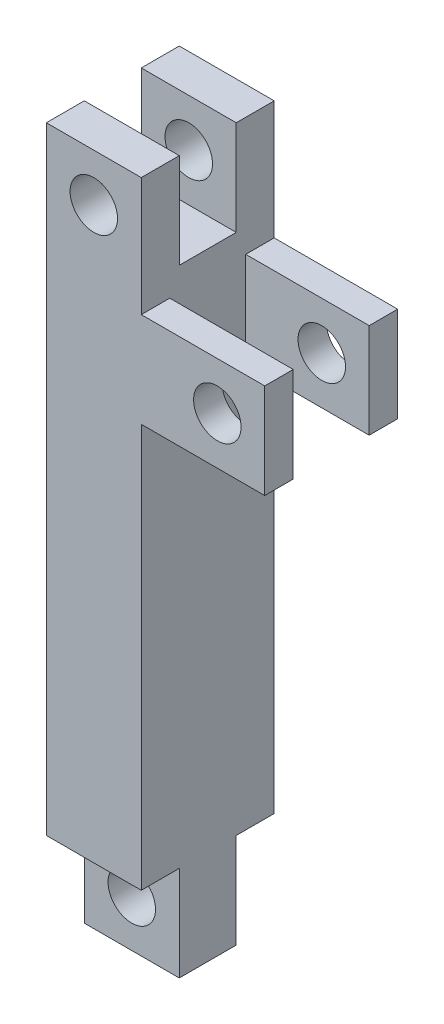
ISO-10303-21;
HEADER;
FILE_DESCRIPTION(('STEP AP214'),'2;1');
FILE_NAME('part.step','',(''),(''),'','','');
FILE_SCHEMA(('AUTOMOTIVE_DESIGN { 1 0 10303 214 1 1 1 1 }'));
ENDSEC;
DATA;
#1=APPLICATION_CONTEXT('core data for automotive mechanical design processes');
#2=APPLICATION_PROTOCOL_DEFINITION('international standard','automotive_design',2000,#1);
#3=PRODUCT_CONTEXT('',#1,'mechanical');
#4=PRODUCT('Part','Part','',(#3));
#5=PRODUCT_RELATED_PRODUCT_CATEGORY('part','',(#4));
#6=PRODUCT_DEFINITION_FORMATION('','',#4);
#7=PRODUCT_DEFINITION_CONTEXT('part definition',#1,'design');
#8=PRODUCT_DEFINITION('design','',#6,#7);
#9=PRODUCT_DEFINITION_SHAPE('','',#8);
#10=(LENGTH_UNIT() NAMED_UNIT(*) SI_UNIT(.MILLI.,.METRE.));
#11=(NAMED_UNIT(*) PLANE_ANGLE_UNIT() SI_UNIT($,.RADIAN.));
#12=(NAMED_UNIT(*) SI_UNIT($,.STERADIAN.) SOLID_ANGLE_UNIT());
#13=UNCERTAINTY_MEASURE_WITH_UNIT(LENGTH_MEASURE(1.E-05),#10,'distance_accuracy_value','');
#14=(GEOMETRIC_REPRESENTATION_CONTEXT(3) GLOBAL_UNCERTAINTY_ASSIGNED_CONTEXT((#13)) GLOBAL_UNIT_ASSIGNED_CONTEXT((#10,
#11,#12)) REPRESENTATION_CONTEXT('',''));
#15=CARTESIAN_POINT('',(0.,0.,0.));
#16=DIRECTION('',(0.,0.,1.));
#17=DIRECTION('',(1.,0.,0.));
#18=AXIS2_PLACEMENT_3D('',#15,#16,#17);
#19=CARTESIAN_POINT('',(0.,-32.5,0.));
#20=DIRECTION('',(0.,-1.,0.));
#21=DIRECTION('',(0.,0.,-1.));
#22=AXIS2_PLACEMENT_3D('',#19,#20,#21);
#23=PLANE('',#22);
#24=DIRECTION('',(0.,0.,-1.));
#25=VECTOR('',#24,1.);
#26=CARTESIAN_POINT('',(5.,-32.5,-7.));
#27=LINE('',#26,#25);
#28=CARTESIAN_POINT('',(5.,-32.5,-3.));
#29=VERTEX_POINT('',#28);
#30=CARTESIAN_POINT('',(5.,-32.5,-7.));
#31=VERTEX_POINT('',#30);
#32=EDGE_CURVE('E62',#29,#31,#27,.T.);
#33=ORIENTED_EDGE('',*,*,#32,.F.);
#34=DIRECTION('',(-1.,0.,0.));
#35=VECTOR('',#34,1.);
#36=CARTESIAN_POINT('',(5.,-32.5,-3.));
#37=LINE('',#36,#35);
#38=CARTESIAN_POINT('',(-5.,-32.5,-3.));
#39=VERTEX_POINT('',#38);
#40=EDGE_CURVE('E57',#29,#39,#37,.T.);
#41=ORIENTED_EDGE('',*,*,#40,.T.);
#42=DIRECTION('',(0.,0.,1.));
#43=VECTOR('',#42,1.);
#44=CARTESIAN_POINT('',(-5.,-32.5,-7.));
#45=LINE('',#44,#43);
#46=CARTESIAN_POINT('',(-5.,-32.5,-7.));
#47=VERTEX_POINT('',#46);
#48=EDGE_CURVE('E190',#47,#39,#45,.T.);
#49=ORIENTED_EDGE('',*,*,#48,.F.);
#50=DIRECTION('',(-1.,0.,0.));
#51=VECTOR('',#50,1.);
#52=CARTESIAN_POINT('',(5.,-32.5,-7.));
#53=LINE('',#52,#51);
#54=EDGE_CURVE('E191',#31,#47,#53,.T.);
#55=ORIENTED_EDGE('',*,*,#54,.F.);
#56=EDGE_LOOP('',(#33,#41,#49,#55));
#57=FACE_BOUND('',#56,.T.);
#58=ADVANCED_FACE('F39',(#57),#23,.T.);
#59=CARTESIAN_POINT('',(5.,32.5,-7.));
#60=DIRECTION('',(-1.,0.,0.));
#61=DIRECTION('',(0.,0.,1.));
#62=AXIS2_PLACEMENT_3D('',#59,#60,#61);
#63=PLANE('',#62);
#64=DIRECTION('',(0.,1.,0.));
#65=VECTOR('',#64,1.);
#66=CARTESIAN_POINT('',(5.,32.5,-3.));
#67=LINE('',#66,#65);
#68=CARTESIAN_POINT('',(5.,22.5,-3.));
#69=VERTEX_POINT('',#68);
#70=CARTESIAN_POINT('',(5.,32.5,-3.));
#71=VERTEX_POINT('',#70);
#72=EDGE_CURVE('E243',#69,#71,#67,.T.);
#73=ORIENTED_EDGE('',*,*,#72,.F.);
#74=DIRECTION('',(0.,0.,1.));
#75=VECTOR('',#74,1.);
#76=CARTESIAN_POINT('',(5.,22.5,-3.));
#77=LINE('',#76,#75);
#78=CARTESIAN_POINT('',(5.,22.5,3.));
#79=VERTEX_POINT('',#78);
#80=EDGE_CURVE('E264',#69,#79,#77,.T.);
#81=ORIENTED_EDGE('',*,*,#80,.T.);
#82=DIRECTION('',(0.,1.,0.));
#83=VECTOR('',#82,1.);
#84=CARTESIAN_POINT('',(5.,32.5,3.));
#85=LINE('',#84,#83);
#86=CARTESIAN_POINT('',(5.,32.5,3.));
#87=VERTEX_POINT('',#86);
#88=EDGE_CURVE('E257',#79,#87,#85,.T.);
#89=ORIENTED_EDGE('',*,*,#88,.T.);
#90=DIRECTION('',(0.,0.,-1.));
#91=VECTOR('',#90,1.);
#92=CARTESIAN_POINT('',(5.,32.5,-7.));
#93=LINE('',#92,#91);
#94=CARTESIAN_POINT('',(5.,32.5,7.));
#95=VERTEX_POINT('',#94);
#96=EDGE_CURVE('E353',#95,#87,#93,.T.);
#97=ORIENTED_EDGE('',*,*,#96,.F.);
#98=DIRECTION('',(0.,-1.,0.));
#99=VECTOR('',#98,1.);
#100=CARTESIAN_POINT('',(5.,32.5,7.));
#101=LINE('',#100,#99);
#102=CARTESIAN_POINT('',(5.,20.,7.));
#103=VERTEX_POINT('',#102);
#104=EDGE_CURVE('E378',#95,#103,#101,.T.);
#105=ORIENTED_EDGE('',*,*,#104,.T.);
#106=DIRECTION('',(0.,0.,-1.));
#107=VECTOR('',#106,1.);
#108=CARTESIAN_POINT('',(5.,20.,7.));
#109=LINE('',#108,#107);
#110=CARTESIAN_POINT('',(5.,20.,4.));
#111=VERTEX_POINT('',#110);
#112=EDGE_CURVE('E334',#103,#111,#109,.T.);
#113=ORIENTED_EDGE('',*,*,#112,.T.);
#114=DIRECTION('',(0.,-1.,0.));
#115=VECTOR('',#114,1.);
#116=CARTESIAN_POINT('',(5.,20.,4.));
#117=LINE('',#116,#115);
#118=CARTESIAN_POINT('',(5.,10.,4.));
#119=VERTEX_POINT('',#118);
#120=EDGE_CURVE('E283',#111,#119,#117,.T.);
#121=ORIENTED_EDGE('',*,*,#120,.T.);
#122=DIRECTION('',(0.,0.,-1.));
#123=VECTOR('',#122,1.);
#124=CARTESIAN_POINT('',(5.,10.,7.));
#125=LINE('',#124,#123);
#126=CARTESIAN_POINT('',(5.,10.,7.));
#127=VERTEX_POINT('',#126);
#128=EDGE_CURVE('E349',#127,#119,#125,.T.);
#129=ORIENTED_EDGE('',*,*,#128,.F.);
#130=CARTESIAN_POINT('',(5.,-32.5,7.));
#131=VERTEX_POINT('',#130);
#132=EDGE_CURVE('E369',#127,#131,#101,.T.);
#133=ORIENTED_EDGE('',*,*,#132,.T.);
#134=CARTESIAN_POINT('',(5.,-32.5,3.));
#135=VERTEX_POINT('',#134);
#136=EDGE_CURVE('E370',#131,#135,#27,.T.);
#137=ORIENTED_EDGE('',*,*,#136,.T.);
#138=DIRECTION('',(0.,1.,0.));
#139=VECTOR('',#138,1.);
#140=CARTESIAN_POINT('',(5.,-32.5,3.));
#141=LINE('',#140,#139);
#142=CARTESIAN_POINT('',(5.,-42.5,3.));
#143=VERTEX_POINT('',#142);
#144=EDGE_CURVE('E199',#143,#135,#141,.T.);
#145=ORIENTED_EDGE('',*,*,#144,.F.);
#146=DIRECTION('',(0.,0.,-1.));
#147=VECTOR('',#146,1.);
#148=CARTESIAN_POINT('',(5.,-42.5,3.));
#149=LINE('',#148,#147);
#150=CARTESIAN_POINT('',(5.,-42.5,-3.));
#151=VERTEX_POINT('',#150);
#152=EDGE_CURVE('E211',#143,#151,#149,.T.);
#153=ORIENTED_EDGE('',*,*,#152,.T.);
#154=DIRECTION('',(0.,1.,0.));
#155=VECTOR('',#154,1.);
#156=CARTESIAN_POINT('',(5.,-32.5,-3.));
#157=LINE('',#156,#155);
#158=EDGE_CURVE('E215',#151,#29,#157,.T.);
#159=ORIENTED_EDGE('',*,*,#158,.T.);
#160=ORIENTED_EDGE('',*,*,#32,.T.);
#161=DIRECTION('',(0.,-1.,0.));
#162=VECTOR('',#161,1.);
#163=CARTESIAN_POINT('',(5.,32.5,-7.));
#164=LINE('',#163,#162);
#165=CARTESIAN_POINT('',(5.,10.,-7.));
#166=VERTEX_POINT('',#165);
#167=EDGE_CURVE('E49',#166,#31,#164,.T.);
#168=ORIENTED_EDGE('',*,*,#167,.F.);
#169=CARTESIAN_POINT('',(5.,10.,-4.));
#170=VERTEX_POINT('',#169);
#171=EDGE_CURVE('E348',#170,#166,#125,.T.);
#172=ORIENTED_EDGE('',*,*,#171,.F.);
#173=DIRECTION('',(0.,-1.,0.));
#174=VECTOR('',#173,1.);
#175=CARTESIAN_POINT('',(5.,20.,-4.));
#176=LINE('',#175,#174);
#177=CARTESIAN_POINT('',(5.,20.,-4.));
#178=VERTEX_POINT('',#177);
#179=EDGE_CURVE('E284',#178,#170,#176,.T.);
#180=ORIENTED_EDGE('',*,*,#179,.F.);
#181=CARTESIAN_POINT('',(5.,20.,-7.));
#182=VERTEX_POINT('',#181);
#183=EDGE_CURVE('E323',#178,#182,#109,.T.);
#184=ORIENTED_EDGE('',*,*,#183,.T.);
#185=CARTESIAN_POINT('',(5.,32.5,-7.));
#186=VERTEX_POINT('',#185);
#187=EDGE_CURVE('E11',#186,#182,#164,.T.);
#188=ORIENTED_EDGE('',*,*,#187,.F.);
#189=EDGE_CURVE('E358',#71,#186,#93,.T.);
#190=ORIENTED_EDGE('',*,*,#189,.F.);
#191=EDGE_LOOP('',(#73,#81,#89,#97,#105,#113,#121,#129,#133,#137,#145,#153,#159,#160,#168,#172,
#180,#184,#188,#190));
#192=FACE_BOUND('',#191,.T.);
#193=ADVANCED_FACE('F41',(#192),#63,.F.);
#194=CARTESIAN_POINT('',(-5.,32.5,-7.));
#195=DIRECTION('',(1.,0.,0.));
#196=DIRECTION('',(0.,0.,-1.));
#197=AXIS2_PLACEMENT_3D('',#194,#195,#196);
#198=PLANE('',#197);
#199=DIRECTION('',(0.,-1.,0.));
#200=VECTOR('',#199,1.);
#201=CARTESIAN_POINT('',(-5.,32.5,-3.));
#202=LINE('',#201,#200);
#203=CARTESIAN_POINT('',(-5.,32.5,-3.));
#204=VERTEX_POINT('',#203);
#205=CARTESIAN_POINT('',(-5.,22.5,-3.));
#206=VERTEX_POINT('',#205);
#207=EDGE_CURVE('E234',#204,#206,#202,.T.);
#208=ORIENTED_EDGE('',*,*,#207,.F.);
#209=DIRECTION('',(0.,0.,1.));
#210=VECTOR('',#209,1.);
#211=CARTESIAN_POINT('',(-5.,32.5,-7.));
#212=LINE('',#211,#210);
#213=CARTESIAN_POINT('',(-5.,32.5,-7.));
#214=VERTEX_POINT('',#213);
#215=EDGE_CURVE('E362',#214,#204,#212,.T.);
#216=ORIENTED_EDGE('',*,*,#215,.F.);
#217=DIRECTION('',(0.,-1.,0.));
#218=VECTOR('',#217,1.);
#219=CARTESIAN_POINT('',(-5.,32.5,-7.));
#220=LINE('',#219,#218);
#221=EDGE_CURVE('E385',#214,#47,#220,.T.);
#222=ORIENTED_EDGE('',*,*,#221,.T.);
#223=ORIENTED_EDGE('',*,*,#48,.T.);
#224=DIRECTION('',(0.,-1.,0.));
#225=VECTOR('',#224,1.);
#226=CARTESIAN_POINT('',(-5.,-32.5,-3.));
#227=LINE('',#226,#225);
#228=CARTESIAN_POINT('',(-5.,-42.5,-3.));
#229=VERTEX_POINT('',#228);
#230=EDGE_CURVE('E222',#39,#229,#227,.T.);
#231=ORIENTED_EDGE('',*,*,#230,.T.);
#232=DIRECTION('',(0.,0.,-1.));
#233=VECTOR('',#232,1.);
#234=CARTESIAN_POINT('',(-5.,-42.5,3.));
#235=LINE('',#234,#233);
#236=CARTESIAN_POINT('',(-5.,-42.5,3.));
#237=VERTEX_POINT('',#236);
#238=EDGE_CURVE('E205',#237,#229,#235,.T.);
#239=ORIENTED_EDGE('',*,*,#238,.F.);
#240=DIRECTION('',(0.,-1.,0.));
#241=VECTOR('',#240,1.);
#242=CARTESIAN_POINT('',(-5.,-32.5,3.));
#243=LINE('',#242,#241);
#244=CARTESIAN_POINT('',(-5.,-32.5,3.));
#245=VERTEX_POINT('',#244);
#246=EDGE_CURVE('E196',#245,#237,#243,.T.);
#247=ORIENTED_EDGE('',*,*,#246,.F.);
#248=CARTESIAN_POINT('',(-5.,-32.5,7.));
#249=VERTEX_POINT('',#248);
#250=EDGE_CURVE('E177',#245,#249,#45,.T.);
#251=ORIENTED_EDGE('',*,*,#250,.T.);
#252=DIRECTION('',(0.,-1.,0.));
#253=VECTOR('',#252,1.);
#254=CARTESIAN_POINT('',(-5.,32.5,7.));
#255=LINE('',#254,#253);
#256=CARTESIAN_POINT('',(-5.,32.5,7.));
#257=VERTEX_POINT('',#256);
#258=EDGE_CURVE('E382',#257,#249,#255,.T.);
#259=ORIENTED_EDGE('',*,*,#258,.F.);
#260=CARTESIAN_POINT('',(-5.,32.5,3.));
#261=VERTEX_POINT('',#260);
#262=EDGE_CURVE('E361',#261,#257,#212,.T.);
#263=ORIENTED_EDGE('',*,*,#262,.F.);
#264=DIRECTION('',(0.,-1.,0.));
#265=VECTOR('',#264,1.);
#266=CARTESIAN_POINT('',(-5.,32.5,3.));
#267=LINE('',#266,#265);
#268=CARTESIAN_POINT('',(-5.,22.5,3.));
#269=VERTEX_POINT('',#268);
#270=EDGE_CURVE('E233',#261,#269,#267,.T.);
#271=ORIENTED_EDGE('',*,*,#270,.T.);
#272=DIRECTION('',(0.,0.,1.));
#273=VECTOR('',#272,1.);
#274=CARTESIAN_POINT('',(-5.,22.5,-3.));
#275=LINE('',#274,#273);
#276=EDGE_CURVE('E249',#206,#269,#275,.T.);
#277=ORIENTED_EDGE('',*,*,#276,.F.);
#278=EDGE_LOOP('',(#208,#216,#222,#223,#231,#239,#247,#251,#259,#263,#271,#277));
#279=FACE_BOUND('',#278,.T.);
#280=ADVANCED_FACE('F203',(#279),#198,.F.);
#281=CARTESIAN_POINT('',(0.,32.5,0.));
#282=DIRECTION('',(0.,-1.,0.));
#283=DIRECTION('',(0.,0.,-1.));
#284=AXIS2_PLACEMENT_3D('',#281,#282,#283);
#285=PLANE('',#284);
#286=DIRECTION('',(-1.,0.,0.));
#287=VECTOR('',#286,1.);
#288=CARTESIAN_POINT('',(-5.,32.5,-3.));
#289=LINE('',#288,#287);
#290=EDGE_CURVE('E246',#71,#204,#289,.T.);
#291=ORIENTED_EDGE('',*,*,#290,.F.);
#292=ORIENTED_EDGE('',*,*,#189,.T.);
#293=DIRECTION('',(-1.,0.,0.));
#294=VECTOR('',#293,1.);
#295=CARTESIAN_POINT('',(5.,32.5,-7.));
#296=LINE('',#295,#294);
#297=EDGE_CURVE('E357',#186,#214,#296,.T.);
#298=ORIENTED_EDGE('',*,*,#297,.T.);
#299=ORIENTED_EDGE('',*,*,#215,.T.);
#300=EDGE_LOOP('',(#291,#292,#298,#299));
#301=FACE_BOUND('',#300,.T.);
#302=ADVANCED_FACE('F469',(#301),#285,.F.);
#303=CARTESIAN_POINT('',(5.,10.,7.));
#304=DIRECTION('',(0.,1.,0.));
#305=DIRECTION('',(0.,0.,1.));
#306=AXIS2_PLACEMENT_3D('',#303,#304,#305);
#307=PLANE('',#306);
#308=DIRECTION('',(1.,0.,0.));
#309=VECTOR('',#308,1.);
#310=CARTESIAN_POINT('',(5.,10.,-4.));
#311=LINE('',#310,#309);
#312=CARTESIAN_POINT('',(18.,10.,-4.));
#313=VERTEX_POINT('',#312);
#314=EDGE_CURVE('E287',#170,#313,#311,.T.);
#315=ORIENTED_EDGE('',*,*,#314,.F.);
#316=ORIENTED_EDGE('',*,*,#171,.T.);
#317=DIRECTION('',(1.,0.,0.));
#318=VECTOR('',#317,1.);
#319=CARTESIAN_POINT('',(5.,10.,-7.));
#320=LINE('',#319,#318);
#321=CARTESIAN_POINT('',(18.,10.,-7.));
#322=VERTEX_POINT('',#321);
#323=EDGE_CURVE('E298',#166,#322,#320,.T.);
#324=ORIENTED_EDGE('',*,*,#323,.T.);
#325=DIRECTION('',(0.,0.,-1.));
#326=VECTOR('',#325,1.);
#327=CARTESIAN_POINT('',(18.,10.,7.));
#328=LINE('',#327,#326);
#329=EDGE_CURVE('E343',#313,#322,#328,.T.);
#330=ORIENTED_EDGE('',*,*,#329,.F.);
#331=EDGE_LOOP('',(#315,#316,#324,#330));
#332=FACE_BOUND('',#331,.T.);
#333=ADVANCED_FACE('F466',(#332),#307,.F.);
#334=CARTESIAN_POINT('',(18.,10.,7.));
#335=DIRECTION('',(-1.,0.,0.));
#336=DIRECTION('',(0.,0.,1.));
#337=AXIS2_PLACEMENT_3D('',#334,#335,#336);
#338=PLANE('',#337);
#339=DIRECTION('',(0.,1.,0.));
#340=VECTOR('',#339,1.);
#341=CARTESIAN_POINT('',(18.,20.,-4.));
#342=LINE('',#341,#340);
#343=CARTESIAN_POINT('',(18.,20.,-4.));
#344=VERTEX_POINT('',#343);
#345=EDGE_CURVE('E291',#313,#344,#342,.T.);
#346=ORIENTED_EDGE('',*,*,#345,.F.);
#347=ORIENTED_EDGE('',*,*,#329,.T.);
#348=DIRECTION('',(0.,1.,0.));
#349=VECTOR('',#348,1.);
#350=CARTESIAN_POINT('',(18.,10.,-7.));
#351=LINE('',#350,#349);
#352=CARTESIAN_POINT('',(18.,20.,-7.));
#353=VERTEX_POINT('',#352);
#354=EDGE_CURVE('E327',#322,#353,#351,.T.);
#355=ORIENTED_EDGE('',*,*,#354,.T.);
#356=DIRECTION('',(0.,0.,-1.));
#357=VECTOR('',#356,1.);
#358=CARTESIAN_POINT('',(18.,20.,7.));
#359=LINE('',#358,#357);
#360=EDGE_CURVE('E338',#344,#353,#359,.T.);
#361=ORIENTED_EDGE('',*,*,#360,.F.);
#362=EDGE_LOOP('',(#346,#347,#355,#361));
#363=FACE_BOUND('',#362,.T.);
#364=ADVANCED_FACE('F481',(#363),#338,.F.);
#365=CARTESIAN_POINT('',(5.,20.,7.));
#366=DIRECTION('',(0.,-1.,0.));
#367=DIRECTION('',(0.,0.,-1.));
#368=AXIS2_PLACEMENT_3D('',#365,#366,#367);
#369=PLANE('',#368);
#370=DIRECTION('',(-1.,0.,0.));
#371=VECTOR('',#370,1.);
#372=CARTESIAN_POINT('',(5.,20.,-4.));
#373=LINE('',#372,#371);
#374=EDGE_CURVE('E294',#344,#178,#373,.T.);
#375=ORIENTED_EDGE('',*,*,#374,.F.);
#376=ORIENTED_EDGE('',*,*,#360,.T.);
#377=DIRECTION('',(-1.,0.,0.));
#378=VECTOR('',#377,1.);
#379=CARTESIAN_POINT('',(5.,20.,-7.));
#380=LINE('',#379,#378);
#381=EDGE_CURVE('E317',#353,#182,#380,.T.);
#382=ORIENTED_EDGE('',*,*,#381,.T.);
#383=ORIENTED_EDGE('',*,*,#183,.F.);
#384=EDGE_LOOP('',(#375,#376,#382,#383));
#385=FACE_BOUND('',#384,.T.);
#386=ADVANCED_FACE('F501',(#385),#369,.F.);
#387=CARTESIAN_POINT('',(5.,32.5,-7.));
#388=DIRECTION('',(0.,0.,1.));
#389=DIRECTION('',(1.,0.,0.));
#390=AXIS2_PLACEMENT_3D('',#387,#388,#389);
#391=PLANE('',#390);
#392=CARTESIAN_POINT('',(0.,27.5,-7.));
#393=DIRECTION('',(0.,0.,1.));
#394=DIRECTION('',(1.,0.,0.));
#395=AXIS2_PLACEMENT_3D('',#392,#393,#394);
#396=CIRCLE('',#395,2.5);
#397=CARTESIAN_POINT('',(2.5,27.5,-7.));
#398=VERTEX_POINT('',#397);
#399=EDGE_CURVE('E394',#398,#398,#396,.T.);
#400=ORIENTED_EDGE('',*,*,#399,.T.);
#401=EDGE_LOOP('',(#400));
#402=FACE_BOUND('',#401,.T.);
#403=CARTESIAN_POINT('',(13.0055352682505,15.,-7.));
#404=DIRECTION('',(0.,0.,1.));
#405=DIRECTION('',(1.,0.,0.));
#406=AXIS2_PLACEMENT_3D('',#403,#404,#405);
#407=CIRCLE('',#406,2.5);
#408=CARTESIAN_POINT('',(15.5055352682505,15.,-7.));
#409=VERTEX_POINT('',#408);
#410=EDGE_CURVE('E274',#409,#409,#407,.T.);
#411=ORIENTED_EDGE('',*,*,#410,.T.);
#412=EDGE_LOOP('',(#411));
#413=FACE_BOUND('',#412,.T.);
#414=ORIENTED_EDGE('',*,*,#54,.T.);
#415=ORIENTED_EDGE('',*,*,#221,.F.);
#416=ORIENTED_EDGE('',*,*,#297,.F.);
#417=ORIENTED_EDGE('',*,*,#187,.T.);
#418=ORIENTED_EDGE('',*,*,#381,.F.);
#419=ORIENTED_EDGE('',*,*,#354,.F.);
#420=ORIENTED_EDGE('',*,*,#323,.F.);
#421=ORIENTED_EDGE('',*,*,#167,.T.);
#422=EDGE_LOOP('',(#414,#415,#416,#417,#418,#419,#420,#421));
#423=FACE_BOUND('',#422,.T.);
#424=ADVANCED_FACE('F473',(#402,#413,#423),#391,.F.);
#425=CARTESIAN_POINT('',(5.,32.5,7.));
#426=DIRECTION('',(0.,0.,-1.));
#427=DIRECTION('',(-1.,0.,0.));
#428=AXIS2_PLACEMENT_3D('',#425,#426,#427);
#429=PLANE('',#428);
#430=CARTESIAN_POINT('',(0.,27.5,7.));
#431=DIRECTION('',(0.,0.,1.));
#432=DIRECTION('',(1.,0.,0.));
#433=AXIS2_PLACEMENT_3D('',#430,#431,#432);
#434=CIRCLE('',#433,2.5);
#435=CARTESIAN_POINT('',(2.5,27.5,7.));
#436=VERTEX_POINT('',#435);
#437=EDGE_CURVE('E402',#436,#436,#434,.T.);
#438=ORIENTED_EDGE('',*,*,#437,.F.);
#439=EDGE_LOOP('',(#438));
#440=FACE_BOUND('',#439,.T.);
#441=CARTESIAN_POINT('',(13.0055352682505,15.,7.));
#442=DIRECTION('',(0.,0.,1.));
#443=DIRECTION('',(1.,0.,0.));
#444=AXIS2_PLACEMENT_3D('',#441,#442,#443);
#445=CIRCLE('',#444,2.5);
#446=CARTESIAN_POINT('',(15.5055352682505,15.,7.));
#447=VERTEX_POINT('',#446);
#448=EDGE_CURVE('E268',#447,#447,#445,.T.);
#449=ORIENTED_EDGE('',*,*,#448,.F.);
#450=EDGE_LOOP('',(#449));
#451=FACE_BOUND('',#450,.T.);
#452=DIRECTION('',(1.,0.,0.));
#453=VECTOR('',#452,1.);
#454=CARTESIAN_POINT('',(5.,-32.5,7.));
#455=LINE('',#454,#453);
#456=EDGE_CURVE('E184',#249,#131,#455,.T.);
#457=ORIENTED_EDGE('',*,*,#456,.T.);
#458=ORIENTED_EDGE('',*,*,#132,.F.);
#459=DIRECTION('',(1.,0.,0.));
#460=VECTOR('',#459,1.);
#461=CARTESIAN_POINT('',(5.,10.,7.));
#462=LINE('',#461,#460);
#463=CARTESIAN_POINT('',(18.,10.,7.));
#464=VERTEX_POINT('',#463);
#465=EDGE_CURVE('E313',#127,#464,#462,.T.);
#466=ORIENTED_EDGE('',*,*,#465,.T.);
#467=DIRECTION('',(0.,1.,0.));
#468=VECTOR('',#467,1.);
#469=CARTESIAN_POINT('',(18.,10.,7.));
#470=LINE('',#469,#468);
#471=CARTESIAN_POINT('',(18.,20.,7.));
#472=VERTEX_POINT('',#471);
#473=EDGE_CURVE('E316',#464,#472,#470,.T.);
#474=ORIENTED_EDGE('',*,*,#473,.T.);
#475=DIRECTION('',(-1.,0.,0.));
#476=VECTOR('',#475,1.);
#477=CARTESIAN_POINT('',(5.,20.,7.));
#478=LINE('',#477,#476);
#479=EDGE_CURVE('E320',#472,#103,#478,.T.);
#480=ORIENTED_EDGE('',*,*,#479,.T.);
#481=ORIENTED_EDGE('',*,*,#104,.F.);
#482=DIRECTION('',(1.,0.,0.));
#483=VECTOR('',#482,1.);
#484=CARTESIAN_POINT('',(5.,32.5,7.));
#485=LINE('',#484,#483);
#486=EDGE_CURVE('E366',#257,#95,#485,.T.);
#487=ORIENTED_EDGE('',*,*,#486,.F.);
#488=ORIENTED_EDGE('',*,*,#258,.T.);
#489=EDGE_LOOP('',(#457,#458,#466,#474,#480,#481,#487,#488));
#490=FACE_BOUND('',#489,.T.);
#491=ADVANCED_FACE('F467',(#440,#451,#490),#429,.F.);
#492=ORIENTED_EDGE('',*,*,#96,.T.);
#493=DIRECTION('',(-1.,0.,0.));
#494=VECTOR('',#493,1.);
#495=CARTESIAN_POINT('',(-5.,32.5,3.));
#496=LINE('',#495,#494);
#497=EDGE_CURVE('E239',#87,#261,#496,.T.);
#498=ORIENTED_EDGE('',*,*,#497,.T.);
#499=ORIENTED_EDGE('',*,*,#262,.T.);
#500=ORIENTED_EDGE('',*,*,#486,.T.);
#501=EDGE_LOOP('',(#492,#498,#499,#500));
#502=FACE_BOUND('',#501,.T.);
#503=ADVANCED_FACE('F458',(#502),#285,.F.);
#504=DIRECTION('',(-1.,0.,0.));
#505=VECTOR('',#504,1.);
#506=CARTESIAN_POINT('',(5.,-32.5,3.));
#507=LINE('',#506,#505);
#508=EDGE_CURVE('E181',#135,#245,#507,.T.);
#509=ORIENTED_EDGE('',*,*,#508,.F.);
#510=ORIENTED_EDGE('',*,*,#136,.F.);
#511=ORIENTED_EDGE('',*,*,#456,.F.);
#512=ORIENTED_EDGE('',*,*,#250,.F.);
#513=EDGE_LOOP('',(#509,#510,#511,#512));
#514=FACE_BOUND('',#513,.T.);
#515=ADVANCED_FACE('F179',(#514),#23,.T.);
#516=ORIENTED_EDGE('',*,*,#128,.T.);
#517=DIRECTION('',(1.,0.,0.));
#518=VECTOR('',#517,1.);
#519=CARTESIAN_POINT('',(5.,10.,4.));
#520=LINE('',#519,#518);
#521=CARTESIAN_POINT('',(18.,10.,4.));
#522=VERTEX_POINT('',#521);
#523=EDGE_CURVE('E302',#119,#522,#520,.T.);
#524=ORIENTED_EDGE('',*,*,#523,.T.);
#525=EDGE_CURVE('E344',#464,#522,#328,.T.);
#526=ORIENTED_EDGE('',*,*,#525,.F.);
#527=ORIENTED_EDGE('',*,*,#465,.F.);
#528=EDGE_LOOP('',(#516,#524,#526,#527));
#529=FACE_BOUND('',#528,.T.);
#530=ADVANCED_FACE('F457',(#529),#307,.F.);
#531=ORIENTED_EDGE('',*,*,#525,.T.);
#532=DIRECTION('',(0.,1.,0.));
#533=VECTOR('',#532,1.);
#534=CARTESIAN_POINT('',(18.,20.,4.));
#535=LINE('',#534,#533);
#536=CARTESIAN_POINT('',(18.,20.,4.));
#537=VERTEX_POINT('',#536);
#538=EDGE_CURVE('E306',#522,#537,#535,.T.);
#539=ORIENTED_EDGE('',*,*,#538,.T.);
#540=EDGE_CURVE('E339',#472,#537,#359,.T.);
#541=ORIENTED_EDGE('',*,*,#540,.F.);
#542=ORIENTED_EDGE('',*,*,#473,.F.);
#543=EDGE_LOOP('',(#531,#539,#541,#542));
#544=FACE_BOUND('',#543,.T.);
#545=ADVANCED_FACE('F463',(#544),#338,.F.);
#546=ORIENTED_EDGE('',*,*,#540,.T.);
#547=DIRECTION('',(-1.,0.,0.));
#548=VECTOR('',#547,1.);
#549=CARTESIAN_POINT('',(5.,20.,4.));
#550=LINE('',#549,#548);
#551=EDGE_CURVE('E288',#537,#111,#550,.T.);
#552=ORIENTED_EDGE('',*,*,#551,.T.);
#553=ORIENTED_EDGE('',*,*,#112,.F.);
#554=ORIENTED_EDGE('',*,*,#479,.F.);
#555=EDGE_LOOP('',(#546,#552,#553,#554));
#556=FACE_BOUND('',#555,.T.);
#557=ADVANCED_FACE('F520',(#556),#369,.F.);
#558=CARTESIAN_POINT('',(0.,0.,-4.));
#559=DIRECTION('',(0.,0.,1.));
#560=DIRECTION('',(1.,0.,0.));
#561=AXIS2_PLACEMENT_3D('',#558,#559,#560);
#562=PLANE('',#561);
#563=CARTESIAN_POINT('',(13.0055352682505,15.,-4.));
#564=DIRECTION('',(0.,0.,1.));
#565=DIRECTION('',(1.,0.,0.));
#566=AXIS2_PLACEMENT_3D('',#563,#564,#565);
#567=CIRCLE('',#566,2.5);
#568=CARTESIAN_POINT('',(15.5055352682505,15.,-4.));
#569=VERTEX_POINT('',#568);
#570=EDGE_CURVE('E279',#569,#569,#567,.T.);
#571=ORIENTED_EDGE('',*,*,#570,.F.);
#572=EDGE_LOOP('',(#571));
#573=FACE_BOUND('',#572,.T.);
#574=ORIENTED_EDGE('',*,*,#179,.T.);
#575=ORIENTED_EDGE('',*,*,#314,.T.);
#576=ORIENTED_EDGE('',*,*,#345,.T.);
#577=ORIENTED_EDGE('',*,*,#374,.T.);
#578=EDGE_LOOP('',(#574,#575,#576,#577));
#579=FACE_BOUND('',#578,.T.);
#580=ADVANCED_FACE('F536',(#573,#579),#562,.T.);
#581=CARTESIAN_POINT('',(0.,0.,4.));
#582=DIRECTION('',(0.,0.,1.));
#583=DIRECTION('',(1.,0.,0.));
#584=AXIS2_PLACEMENT_3D('',#581,#582,#583);
#585=PLANE('',#584);
#586=CARTESIAN_POINT('',(13.0055352682505,15.,4.));
#587=DIRECTION('',(0.,0.,1.));
#588=DIRECTION('',(1.,0.,0.));
#589=AXIS2_PLACEMENT_3D('',#586,#587,#588);
#590=CIRCLE('',#589,2.5);
#591=CARTESIAN_POINT('',(15.5055352682505,15.,4.));
#592=VERTEX_POINT('',#591);
#593=EDGE_CURVE('E278',#592,#592,#590,.T.);
#594=ORIENTED_EDGE('',*,*,#593,.T.);
#595=EDGE_LOOP('',(#594));
#596=FACE_BOUND('',#595,.T.);
#597=ORIENTED_EDGE('',*,*,#120,.F.);
#598=ORIENTED_EDGE('',*,*,#551,.F.);
#599=ORIENTED_EDGE('',*,*,#538,.F.);
#600=ORIENTED_EDGE('',*,*,#523,.F.);
#601=EDGE_LOOP('',(#597,#598,#599,#600));
#602=FACE_BOUND('',#601,.T.);
#603=ADVANCED_FACE('F523',(#596,#602),#585,.F.);
#604=CARTESIAN_POINT('',(13.0055352682505,15.,-7.));
#605=DIRECTION('',(0.,0.,1.));
#606=DIRECTION('',(1.,0.,0.));
#607=AXIS2_PLACEMENT_3D('',#604,#605,#606);
#608=CYLINDRICAL_SURFACE('',#607,2.5);
#609=ORIENTED_EDGE('',*,*,#448,.T.);
#610=EDGE_LOOP('',(#609));
#611=FACE_BOUND('',#610,.T.);
#612=ORIENTED_EDGE('',*,*,#593,.F.);
#613=EDGE_LOOP('',(#612));
#614=FACE_BOUND('',#613,.T.);
#615=ADVANCED_FACE('F555',(#611,#614),#608,.F.);
#616=ORIENTED_EDGE('',*,*,#570,.T.);
#617=EDGE_LOOP('',(#616));
#618=FACE_BOUND('',#617,.T.);
#619=ORIENTED_EDGE('',*,*,#410,.F.);
#620=EDGE_LOOP('',(#619));
#621=FACE_BOUND('',#620,.T.);
#622=ADVANCED_FACE('F558',(#618,#621),#608,.F.);
#623=CARTESIAN_POINT('',(-5.,22.5,-3.));
#624=DIRECTION('',(0.,-1.,0.));
#625=DIRECTION('',(0.,0.,-1.));
#626=AXIS2_PLACEMENT_3D('',#623,#624,#625);
#627=PLANE('',#626);
#628=DIRECTION('',(1.,0.,0.));
#629=VECTOR('',#628,1.);
#630=CARTESIAN_POINT('',(-5.,22.5,3.));
#631=LINE('',#630,#629);
#632=EDGE_CURVE('E253',#269,#79,#631,.T.);
#633=ORIENTED_EDGE('',*,*,#632,.T.);
#634=ORIENTED_EDGE('',*,*,#80,.F.);
#635=DIRECTION('',(1.,0.,0.));
#636=VECTOR('',#635,1.);
#637=CARTESIAN_POINT('',(-5.,22.5,-3.));
#638=LINE('',#637,#636);
#639=EDGE_CURVE('E238',#206,#69,#638,.T.);
#640=ORIENTED_EDGE('',*,*,#639,.F.);
#641=ORIENTED_EDGE('',*,*,#276,.T.);
#642=EDGE_LOOP('',(#633,#634,#640,#641));
#643=FACE_BOUND('',#642,.T.);
#644=ADVANCED_FACE('F508',(#643),#627,.F.);
#645=CARTESIAN_POINT('',(0.,0.,-3.));
#646=DIRECTION('',(0.,0.,1.));
#647=DIRECTION('',(1.,0.,0.));
#648=AXIS2_PLACEMENT_3D('',#645,#646,#647);
#649=PLANE('',#648);
#650=CARTESIAN_POINT('',(0.,27.5,-3.));
#651=DIRECTION('',(0.,0.,1.));
#652=DIRECTION('',(1.,0.,0.));
#653=AXIS2_PLACEMENT_3D('',#650,#651,#652);
#654=CIRCLE('',#653,2.5);
#655=CARTESIAN_POINT('',(2.5,27.5,-3.));
#656=VERTEX_POINT('',#655);
#657=EDGE_CURVE('E219',#656,#656,#654,.T.);
#658=ORIENTED_EDGE('',*,*,#657,.F.);
#659=EDGE_LOOP('',(#658));
#660=FACE_BOUND('',#659,.T.);
#661=ORIENTED_EDGE('',*,*,#207,.T.);
#662=ORIENTED_EDGE('',*,*,#639,.T.);
#663=ORIENTED_EDGE('',*,*,#72,.T.);
#664=ORIENTED_EDGE('',*,*,#290,.T.);
#665=EDGE_LOOP('',(#661,#662,#663,#664));
#666=FACE_BOUND('',#665,.T.);
#667=ADVANCED_FACE('F446',(#660,#666),#649,.T.);
#668=CARTESIAN_POINT('',(0.,0.,3.));
#669=DIRECTION('',(0.,0.,1.));
#670=DIRECTION('',(1.,0.,0.));
#671=AXIS2_PLACEMENT_3D('',#668,#669,#670);
#672=PLANE('',#671);
#673=CARTESIAN_POINT('',(0.,27.5,3.));
#674=DIRECTION('',(0.,0.,1.));
#675=DIRECTION('',(1.,0.,0.));
#676=AXIS2_PLACEMENT_3D('',#673,#674,#675);
#677=CIRCLE('',#676,2.5);
#678=CARTESIAN_POINT('',(2.5,27.5,3.));
#679=VERTEX_POINT('',#678);
#680=EDGE_CURVE('E391',#679,#679,#677,.T.);
#681=ORIENTED_EDGE('',*,*,#680,.T.);
#682=EDGE_LOOP('',(#681));
#683=FACE_BOUND('',#682,.T.);
#684=ORIENTED_EDGE('',*,*,#270,.F.);
#685=ORIENTED_EDGE('',*,*,#497,.F.);
#686=ORIENTED_EDGE('',*,*,#88,.F.);
#687=ORIENTED_EDGE('',*,*,#632,.F.);
#688=EDGE_LOOP('',(#684,#685,#686,#687));
#689=FACE_BOUND('',#688,.T.);
#690=ADVANCED_FACE('F439',(#683,#689),#672,.F.);
#691=CARTESIAN_POINT('',(5.,-42.5,3.));
#692=DIRECTION('',(0.,1.,0.));
#693=DIRECTION('',(0.,0.,1.));
#694=AXIS2_PLACEMENT_3D('',#691,#692,#693);
#695=PLANE('',#694);
#696=DIRECTION('',(1.,0.,0.));
#697=VECTOR('',#696,1.);
#698=CARTESIAN_POINT('',(5.,-42.5,-3.));
#699=LINE('',#698,#697);
#700=EDGE_CURVE('E225',#229,#151,#699,.T.);
#701=ORIENTED_EDGE('',*,*,#700,.T.);
#702=ORIENTED_EDGE('',*,*,#152,.F.);
#703=DIRECTION('',(1.,0.,0.));
#704=VECTOR('',#703,1.);
#705=CARTESIAN_POINT('',(5.,-42.5,3.));
#706=LINE('',#705,#704);
#707=EDGE_CURVE('E208',#237,#143,#706,.T.);
#708=ORIENTED_EDGE('',*,*,#707,.F.);
#709=ORIENTED_EDGE('',*,*,#238,.T.);
#710=EDGE_LOOP('',(#701,#702,#708,#709));
#711=FACE_BOUND('',#710,.T.);
#712=ADVANCED_FACE('F437',(#711),#695,.F.);
#713=CARTESIAN_POINT('',(0.,0.,3.));
#714=DIRECTION('',(0.,0.,-1.));
#715=DIRECTION('',(-1.,0.,0.));
#716=AXIS2_PLACEMENT_3D('',#713,#714,#715);
#717=PLANE('',#716);
#718=CARTESIAN_POINT('',(0.,-37.5,3.));
#719=DIRECTION('',(0.,0.,-1.));
#720=DIRECTION('',(-1.,0.,0.));
#721=AXIS2_PLACEMENT_3D('',#718,#719,#720);
#722=CIRCLE('',#721,2.5);
#723=CARTESIAN_POINT('',(-2.5,-37.5,3.));
#724=VERTEX_POINT('',#723);
#725=EDGE_CURVE('E408',#724,#724,#722,.T.);
#726=ORIENTED_EDGE('',*,*,#725,.T.);
#727=EDGE_LOOP('',(#726));
#728=FACE_BOUND('',#727,.T.);
#729=ORIENTED_EDGE('',*,*,#144,.T.);
#730=ORIENTED_EDGE('',*,*,#508,.T.);
#731=ORIENTED_EDGE('',*,*,#246,.T.);
#732=ORIENTED_EDGE('',*,*,#707,.T.);
#733=EDGE_LOOP('',(#729,#730,#731,#732));
#734=FACE_BOUND('',#733,.T.);
#735=ADVANCED_FACE('F195',(#728,#734),#717,.F.);
#736=CARTESIAN_POINT('',(0.,0.,-3.));
#737=DIRECTION('',(0.,0.,-1.));
#738=DIRECTION('',(-1.,0.,0.));
#739=AXIS2_PLACEMENT_3D('',#736,#737,#738);
#740=PLANE('',#739);
#741=CARTESIAN_POINT('',(0.,-37.5,-3.));
#742=DIRECTION('',(0.,0.,-1.));
#743=DIRECTION('',(-1.,0.,0.));
#744=AXIS2_PLACEMENT_3D('',#741,#742,#743);
#745=CIRCLE('',#744,2.5);
#746=CARTESIAN_POINT('',(-2.5,-37.5,-3.));
#747=VERTEX_POINT('',#746);
#748=EDGE_CURVE('E43',#747,#747,#745,.T.);
#749=ORIENTED_EDGE('',*,*,#748,.F.);
#750=EDGE_LOOP('',(#749));
#751=FACE_BOUND('',#750,.T.);
#752=ORIENTED_EDGE('',*,*,#158,.F.);
#753=ORIENTED_EDGE('',*,*,#700,.F.);
#754=ORIENTED_EDGE('',*,*,#230,.F.);
#755=ORIENTED_EDGE('',*,*,#40,.F.);
#756=EDGE_LOOP('',(#752,#753,#754,#755));
#757=FACE_BOUND('',#756,.T.);
#758=ADVANCED_FACE('F423',(#751,#757),#740,.T.);
#759=CARTESIAN_POINT('',(0.,27.5,-7.));
#760=DIRECTION('',(0.,0.,1.));
#761=DIRECTION('',(1.,0.,0.));
#762=AXIS2_PLACEMENT_3D('',#759,#760,#761);
#763=CYLINDRICAL_SURFACE('',#762,2.5);
#764=ORIENTED_EDGE('',*,*,#437,.T.);
#765=EDGE_LOOP('',(#764));
#766=FACE_BOUND('',#765,.T.);
#767=ORIENTED_EDGE('',*,*,#680,.F.);
#768=EDGE_LOOP('',(#767));
#769=FACE_BOUND('',#768,.T.);
#770=ADVANCED_FACE('F426',(#766,#769),#763,.F.);
#771=ORIENTED_EDGE('',*,*,#657,.T.);
#772=EDGE_LOOP('',(#771));
#773=FACE_BOUND('',#772,.T.);
#774=ORIENTED_EDGE('',*,*,#399,.F.);
#775=EDGE_LOOP('',(#774));
#776=FACE_BOUND('',#775,.T.);
#777=ADVANCED_FACE('F569',(#773,#776),#763,.F.);
#778=CARTESIAN_POINT('',(0.,-37.5,-7.));
#779=DIRECTION('',(0.,0.,1.));
#780=DIRECTION('',(1.,0.,0.));
#781=AXIS2_PLACEMENT_3D('',#778,#779,#780);
#782=CYLINDRICAL_SURFACE('',#781,2.5);
#783=ORIENTED_EDGE('',*,*,#748,.T.);
#784=EDGE_LOOP('',(#783));
#785=FACE_BOUND('',#784,.T.);
#786=ORIENTED_EDGE('',*,*,#725,.F.);
#787=EDGE_LOOP('',(#786));
#788=FACE_BOUND('',#787,.T.);
#789=ADVANCED_FACE('F420',(#785,#788),#782,.F.);
#790=CLOSED_SHELL('',(#58,#193,#280,#302,#333,#364,#386,#424,#491,#503,#515,#530,#545,#557,#580,
#603,#615,#622,#644,#667,#690,#712,#735,#758,#770,#777,#789));
#791=MANIFOLD_SOLID_BREP('B2',#790);
#792=ADVANCED_BREP_SHAPE_REPRESENTATION('',(#18,#791),#14);
#793=SHAPE_DEFINITION_REPRESENTATION(#9,#792);
ENDSEC;
END-ISO-10303-21;
